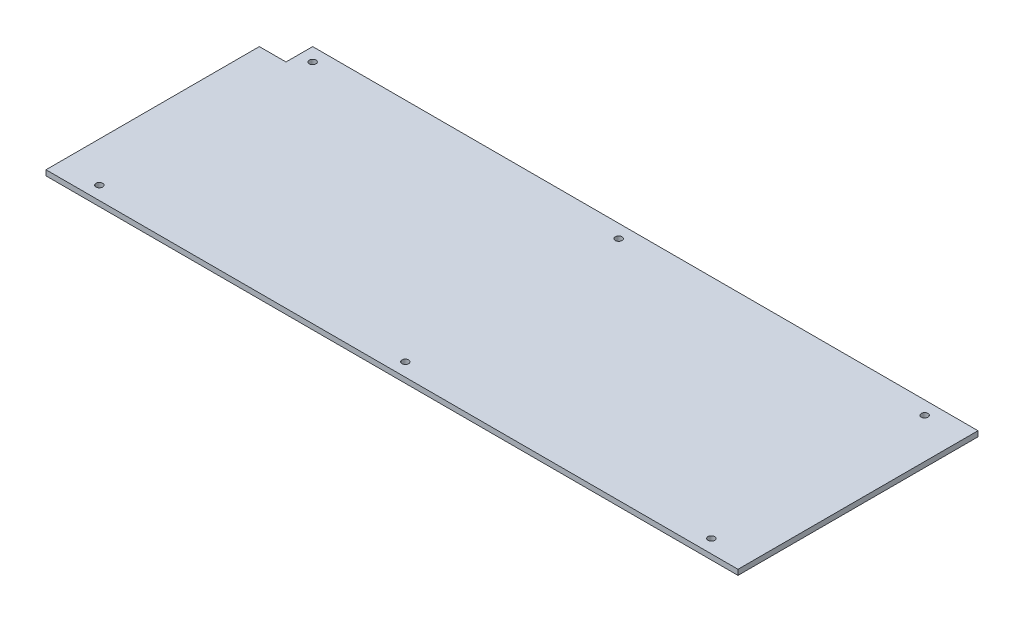
ISO-10303-21;
HEADER;
FILE_DESCRIPTION(('STEP AP214'),'2;1');
FILE_NAME('part.step','',(''),(''),'','','');
FILE_SCHEMA(('AUTOMOTIVE_DESIGN { 1 0 10303 214 1 1 1 1 }'));
ENDSEC;
DATA;
#1=APPLICATION_CONTEXT('core data for automotive mechanical design processes');
#2=APPLICATION_PROTOCOL_DEFINITION('international standard','automotive_design',2000,#1);
#3=PRODUCT_CONTEXT('',#1,'mechanical');
#4=PRODUCT('Part','Part','',(#3));
#5=PRODUCT_RELATED_PRODUCT_CATEGORY('part','',(#4));
#6=PRODUCT_DEFINITION_FORMATION('','',#4);
#7=PRODUCT_DEFINITION_CONTEXT('part definition',#1,'design');
#8=PRODUCT_DEFINITION('design','',#6,#7);
#9=PRODUCT_DEFINITION_SHAPE('','',#8);
#10=(LENGTH_UNIT() NAMED_UNIT(*) SI_UNIT(.MILLI.,.METRE.));
#11=(NAMED_UNIT(*) PLANE_ANGLE_UNIT() SI_UNIT($,.RADIAN.));
#12=(NAMED_UNIT(*) SI_UNIT($,.STERADIAN.) SOLID_ANGLE_UNIT());
#13=UNCERTAINTY_MEASURE_WITH_UNIT(LENGTH_MEASURE(1.E-05),#10,'distance_accuracy_value','');
#14=(GEOMETRIC_REPRESENTATION_CONTEXT(3) GLOBAL_UNCERTAINTY_ASSIGNED_CONTEXT((#13)) GLOBAL_UNIT_ASSIGNED_CONTEXT((#10,
#11,#12)) REPRESENTATION_CONTEXT('',''));
#15=CARTESIAN_POINT('',(0.,0.,0.));
#16=DIRECTION('',(0.,0.,1.));
#17=DIRECTION('',(1.,0.,0.));
#18=AXIS2_PLACEMENT_3D('',#15,#16,#17);
#19=CARTESIAN_POINT('',(0.,4.,0.));
#20=DIRECTION('',(0.,1.,0.));
#21=DIRECTION('',(0.,0.,1.));
#22=AXIS2_PLACEMENT_3D('',#19,#20,#21);
#23=PLANE('',#22);
#24=CARTESIAN_POINT('',(0.,4.,-80.0000000000001));
#25=DIRECTION('',(0.,1.,0.));
#26=DIRECTION('',(0.,0.,1.));
#27=AXIS2_PLACEMENT_3D('',#24,#25,#26);
#28=CIRCLE('',#27,2.5);
#29=CARTESIAN_POINT('',(0.,4.,-77.5000000000001));
#30=VERTEX_POINT('',#29);
#31=EDGE_CURVE('E220',#30,#30,#28,.T.);
#32=ORIENTED_EDGE('',*,*,#31,.F.);
#33=EDGE_LOOP('',(#32));
#34=FACE_BOUND('',#33,.T.);
#35=CARTESIAN_POINT('',(-229.5,4.,80.));
#36=DIRECTION('',(0.,1.,0.));
#37=DIRECTION('',(0.,0.,-1.));
#38=AXIS2_PLACEMENT_3D('',#35,#36,#37);
#39=CIRCLE('',#38,2.5);
#40=CARTESIAN_POINT('',(-229.5,4.,77.5));
#41=VERTEX_POINT('',#40);
#42=EDGE_CURVE('E236',#41,#41,#39,.T.);
#43=ORIENTED_EDGE('',*,*,#42,.F.);
#44=EDGE_LOOP('',(#43));
#45=FACE_BOUND('',#44,.T.);
#46=CARTESIAN_POINT('',(-229.5,4.,-80.));
#47=DIRECTION('',(0.,1.,0.));
#48=DIRECTION('',(0.,0.,1.));
#49=AXIS2_PLACEMENT_3D('',#46,#47,#48);
#50=CIRCLE('',#49,2.5);
#51=CARTESIAN_POINT('',(-229.5,4.,-77.5));
#52=VERTEX_POINT('',#51);
#53=EDGE_CURVE('E134',#52,#52,#50,.T.);
#54=ORIENTED_EDGE('',*,*,#53,.F.);
#55=EDGE_LOOP('',(#54));
#56=FACE_BOUND('',#55,.T.);
#57=DIRECTION('',(-1.,0.,0.));
#58=VECTOR('',#57,1.);
#59=CARTESIAN_POINT('',(259.5,4.,-90.0000000000001));
#60=LINE('',#59,#58);
#61=CARTESIAN_POINT('',(259.5,4.,-90.0000000000001));
#62=VERTEX_POINT('',#61);
#63=CARTESIAN_POINT('',(-239.5,4.,-90.));
#64=VERTEX_POINT('',#63);
#65=EDGE_CURVE('E146',#62,#64,#60,.T.);
#66=ORIENTED_EDGE('',*,*,#65,.T.);
#67=DIRECTION('',(0.,0.,1.));
#68=VECTOR('',#67,1.);
#69=CARTESIAN_POINT('',(-239.5,4.,-90.));
#70=LINE('',#69,#68);
#71=CARTESIAN_POINT('',(-239.5,4.,-70.));
#72=VERTEX_POINT('',#71);
#73=EDGE_CURVE('E94',#64,#72,#70,.T.);
#74=ORIENTED_EDGE('',*,*,#73,.T.);
#75=DIRECTION('',(-1.,0.,0.));
#76=VECTOR('',#75,1.);
#77=CARTESIAN_POINT('',(-259.5,4.,-70.));
#78=LINE('',#77,#76);
#79=CARTESIAN_POINT('',(-259.5,4.,-70.));
#80=VERTEX_POINT('',#79);
#81=EDGE_CURVE('E107',#72,#80,#78,.T.);
#82=ORIENTED_EDGE('',*,*,#81,.T.);
#83=DIRECTION('',(0.,0.,1.));
#84=VECTOR('',#83,1.);
#85=CARTESIAN_POINT('',(-259.5,4.,-70.));
#86=LINE('',#85,#84);
#87=CARTESIAN_POINT('',(-259.5,4.,90.));
#88=VERTEX_POINT('',#87);
#89=EDGE_CURVE('E101',#80,#88,#86,.T.);
#90=ORIENTED_EDGE('',*,*,#89,.T.);
#91=DIRECTION('',(1.,0.,0.));
#92=VECTOR('',#91,1.);
#93=CARTESIAN_POINT('',(-259.5,4.,90.));
#94=LINE('',#93,#92);
#95=CARTESIAN_POINT('',(259.5,4.,90.0000000000001));
#96=VERTEX_POINT('',#95);
#97=EDGE_CURVE('E105',#88,#96,#94,.T.);
#98=ORIENTED_EDGE('',*,*,#97,.T.);
#99=DIRECTION('',(0.,0.,-1.));
#100=VECTOR('',#99,1.);
#101=CARTESIAN_POINT('',(259.5,4.,90.0000000000001));
#102=LINE('',#101,#100);
#103=EDGE_CURVE('E57',#96,#62,#102,.T.);
#104=ORIENTED_EDGE('',*,*,#103,.T.);
#105=EDGE_LOOP('',(#66,#74,#82,#90,#98,#104));
#106=FACE_BOUND('',#105,.T.);
#107=CARTESIAN_POINT('',(229.5,4.,-80.0000000000001));
#108=DIRECTION('',(0.,1.,0.));
#109=DIRECTION('',(0.,0.,-1.));
#110=AXIS2_PLACEMENT_3D('',#107,#108,#109);
#111=CIRCLE('',#110,2.5);
#112=CARTESIAN_POINT('',(229.5,4.,-82.5000000000001));
#113=VERTEX_POINT('',#112);
#114=EDGE_CURVE('E244',#113,#113,#111,.T.);
#115=ORIENTED_EDGE('',*,*,#114,.F.);
#116=EDGE_LOOP('',(#115));
#117=FACE_BOUND('',#116,.T.);
#118=CARTESIAN_POINT('',(229.5,4.,80.0000000000001));
#119=DIRECTION('',(0.,1.,0.));
#120=DIRECTION('',(0.,0.,1.));
#121=AXIS2_PLACEMENT_3D('',#118,#119,#120);
#122=CIRCLE('',#121,2.5);
#123=CARTESIAN_POINT('',(229.5,4.,82.5000000000001));
#124=VERTEX_POINT('',#123);
#125=EDGE_CURVE('E228',#124,#124,#122,.T.);
#126=ORIENTED_EDGE('',*,*,#125,.F.);
#127=EDGE_LOOP('',(#126));
#128=FACE_BOUND('',#127,.T.);
#129=CARTESIAN_POINT('',(0.,4.,80.));
#130=DIRECTION('',(0.,1.,0.));
#131=DIRECTION('',(0.,0.,-1.));
#132=AXIS2_PLACEMENT_3D('',#129,#130,#131);
#133=CIRCLE('',#132,2.5);
#134=CARTESIAN_POINT('',(0.,4.,77.5));
#135=VERTEX_POINT('',#134);
#136=EDGE_CURVE('E209',#135,#135,#133,.T.);
#137=ORIENTED_EDGE('',*,*,#136,.F.);
#138=EDGE_LOOP('',(#137));
#139=FACE_BOUND('',#138,.T.);
#140=ADVANCED_FACE('F39',(#34,#45,#56,#106,#117,#128,#139),#23,.T.);
#141=CARTESIAN_POINT('',(0.,0.,0.));
#142=DIRECTION('',(0.,1.,0.));
#143=DIRECTION('',(0.,0.,1.));
#144=AXIS2_PLACEMENT_3D('',#141,#142,#143);
#145=PLANE('',#144);
#146=DIRECTION('',(-1.,0.,0.));
#147=VECTOR('',#146,1.);
#148=CARTESIAN_POINT('',(259.5,0.,-90.0000000000001));
#149=LINE('',#148,#147);
#150=CARTESIAN_POINT('',(259.5,0.,-90.0000000000001));
#151=VERTEX_POINT('',#150);
#152=CARTESIAN_POINT('',(-239.5,0.,-90.));
#153=VERTEX_POINT('',#152);
#154=EDGE_CURVE('E129',#151,#153,#149,.T.);
#155=ORIENTED_EDGE('',*,*,#154,.F.);
#156=DIRECTION('',(0.,0.,-1.));
#157=VECTOR('',#156,1.);
#158=CARTESIAN_POINT('',(259.5,0.,90.0000000000001));
#159=LINE('',#158,#157);
#160=CARTESIAN_POINT('',(259.5,0.,90.0000000000001));
#161=VERTEX_POINT('',#160);
#162=EDGE_CURVE('E86',#161,#151,#159,.T.);
#163=ORIENTED_EDGE('',*,*,#162,.F.);
#164=DIRECTION('',(1.,0.,0.));
#165=VECTOR('',#164,1.);
#166=CARTESIAN_POINT('',(-259.5,0.,90.));
#167=LINE('',#166,#165);
#168=CARTESIAN_POINT('',(-259.5,0.,90.));
#169=VERTEX_POINT('',#168);
#170=EDGE_CURVE('E80',#169,#161,#167,.T.);
#171=ORIENTED_EDGE('',*,*,#170,.F.);
#172=DIRECTION('',(0.,0.,1.));
#173=VECTOR('',#172,1.);
#174=CARTESIAN_POINT('',(-259.5,0.,-70.));
#175=LINE('',#174,#173);
#176=CARTESIAN_POINT('',(-259.5,0.,-70.));
#177=VERTEX_POINT('',#176);
#178=EDGE_CURVE('E116',#177,#169,#175,.T.);
#179=ORIENTED_EDGE('',*,*,#178,.F.);
#180=DIRECTION('',(-1.,0.,0.));
#181=VECTOR('',#180,1.);
#182=CARTESIAN_POINT('',(-259.5,0.,-70.));
#183=LINE('',#182,#181);
#184=CARTESIAN_POINT('',(-239.5,0.,-70.));
#185=VERTEX_POINT('',#184);
#186=EDGE_CURVE('E137',#185,#177,#183,.T.);
#187=ORIENTED_EDGE('',*,*,#186,.F.);
#188=DIRECTION('',(0.,0.,1.));
#189=VECTOR('',#188,1.);
#190=CARTESIAN_POINT('',(-239.5,0.,-90.));
#191=LINE('',#190,#189);
#192=EDGE_CURVE('E133',#153,#185,#191,.T.);
#193=ORIENTED_EDGE('',*,*,#192,.F.);
#194=EDGE_LOOP('',(#155,#163,#171,#179,#187,#193));
#195=FACE_BOUND('',#194,.T.);
#196=CARTESIAN_POINT('',(-229.5,0.,-80.));
#197=DIRECTION('',(0.,1.,0.));
#198=DIRECTION('',(0.,0.,1.));
#199=AXIS2_PLACEMENT_3D('',#196,#197,#198);
#200=CIRCLE('',#199,2.5);
#201=CARTESIAN_POINT('',(-229.5,0.,-77.5));
#202=VERTEX_POINT('',#201);
#203=EDGE_CURVE('E248',#202,#202,#200,.T.);
#204=ORIENTED_EDGE('',*,*,#203,.T.);
#205=EDGE_LOOP('',(#204));
#206=FACE_BOUND('',#205,.T.);
#207=CARTESIAN_POINT('',(229.5,0.,-80.0000000000001));
#208=DIRECTION('',(0.,1.,0.));
#209=DIRECTION('',(0.,0.,-1.));
#210=AXIS2_PLACEMENT_3D('',#207,#208,#209);
#211=CIRCLE('',#210,2.5);
#212=CARTESIAN_POINT('',(229.5,0.,-82.5000000000001));
#213=VERTEX_POINT('',#212);
#214=EDGE_CURVE('E240',#213,#213,#211,.T.);
#215=ORIENTED_EDGE('',*,*,#214,.T.);
#216=EDGE_LOOP('',(#215));
#217=FACE_BOUND('',#216,.T.);
#218=CARTESIAN_POINT('',(-229.5,0.,80.));
#219=DIRECTION('',(0.,1.,0.));
#220=DIRECTION('',(0.,0.,-1.));
#221=AXIS2_PLACEMENT_3D('',#218,#219,#220);
#222=CIRCLE('',#221,2.5);
#223=CARTESIAN_POINT('',(-229.5,0.,77.5));
#224=VERTEX_POINT('',#223);
#225=EDGE_CURVE('E232',#224,#224,#222,.T.);
#226=ORIENTED_EDGE('',*,*,#225,.T.);
#227=EDGE_LOOP('',(#226));
#228=FACE_BOUND('',#227,.T.);
#229=CARTESIAN_POINT('',(229.5,0.,80.0000000000001));
#230=DIRECTION('',(0.,1.,0.));
#231=DIRECTION('',(0.,0.,1.));
#232=AXIS2_PLACEMENT_3D('',#229,#230,#231);
#233=CIRCLE('',#232,2.5);
#234=CARTESIAN_POINT('',(229.5,0.,82.5000000000001));
#235=VERTEX_POINT('',#234);
#236=EDGE_CURVE('E224',#235,#235,#233,.T.);
#237=ORIENTED_EDGE('',*,*,#236,.T.);
#238=EDGE_LOOP('',(#237));
#239=FACE_BOUND('',#238,.T.);
#240=CARTESIAN_POINT('',(0.,0.,-80.0000000000001));
#241=DIRECTION('',(0.,1.,0.));
#242=DIRECTION('',(0.,0.,1.));
#243=AXIS2_PLACEMENT_3D('',#240,#241,#242);
#244=CIRCLE('',#243,2.5);
#245=CARTESIAN_POINT('',(0.,0.,-77.5000000000001));
#246=VERTEX_POINT('',#245);
#247=EDGE_CURVE('E217',#246,#246,#244,.T.);
#248=ORIENTED_EDGE('',*,*,#247,.T.);
#249=EDGE_LOOP('',(#248));
#250=FACE_BOUND('',#249,.T.);
#251=CARTESIAN_POINT('',(0.,0.,80.));
#252=DIRECTION('',(0.,1.,0.));
#253=DIRECTION('',(0.,0.,-1.));
#254=AXIS2_PLACEMENT_3D('',#251,#252,#253);
#255=CIRCLE('',#254,2.5);
#256=CARTESIAN_POINT('',(0.,0.,77.5));
#257=VERTEX_POINT('',#256);
#258=EDGE_CURVE('E212',#257,#257,#255,.T.);
#259=ORIENTED_EDGE('',*,*,#258,.T.);
#260=EDGE_LOOP('',(#259));
#261=FACE_BOUND('',#260,.T.);
#262=ADVANCED_FACE('F159',(#195,#206,#217,#228,#239,#250,#261),#145,.F.);
#263=CARTESIAN_POINT('',(259.5,4.,-90.0000000000001));
#264=DIRECTION('',(0.,0.,1.));
#265=DIRECTION('',(1.,0.,0.));
#266=AXIS2_PLACEMENT_3D('',#263,#264,#265);
#267=PLANE('',#266);
#268=ORIENTED_EDGE('',*,*,#154,.T.);
#269=DIRECTION('',(0.,-1.,0.));
#270=VECTOR('',#269,1.);
#271=CARTESIAN_POINT('',(-239.5,4.,-90.));
#272=LINE('',#271,#270);
#273=EDGE_CURVE('E11',#64,#153,#272,.T.);
#274=ORIENTED_EDGE('',*,*,#273,.F.);
#275=ORIENTED_EDGE('',*,*,#65,.F.);
#276=DIRECTION('',(0.,-1.,0.));
#277=VECTOR('',#276,1.);
#278=CARTESIAN_POINT('',(259.5,4.,-90.0000000000001));
#279=LINE('',#278,#277);
#280=EDGE_CURVE('E125',#62,#151,#279,.T.);
#281=ORIENTED_EDGE('',*,*,#280,.T.);
#282=EDGE_LOOP('',(#268,#274,#275,#281));
#283=FACE_BOUND('',#282,.T.);
#284=ADVANCED_FACE('F41',(#283),#267,.F.);
#285=CARTESIAN_POINT('',(-239.5,4.,-90.));
#286=DIRECTION('',(1.,0.,0.));
#287=DIRECTION('',(0.,0.,-1.));
#288=AXIS2_PLACEMENT_3D('',#285,#286,#287);
#289=PLANE('',#288);
#290=ORIENTED_EDGE('',*,*,#192,.T.);
#291=DIRECTION('',(0.,-1.,0.));
#292=VECTOR('',#291,1.);
#293=CARTESIAN_POINT('',(-239.5,4.,-70.));
#294=LINE('',#293,#292);
#295=EDGE_CURVE('E49',#72,#185,#294,.T.);
#296=ORIENTED_EDGE('',*,*,#295,.F.);
#297=ORIENTED_EDGE('',*,*,#73,.F.);
#298=ORIENTED_EDGE('',*,*,#273,.T.);
#299=EDGE_LOOP('',(#290,#296,#297,#298));
#300=FACE_BOUND('',#299,.T.);
#301=ADVANCED_FACE('F330',(#300),#289,.F.);
#302=CARTESIAN_POINT('',(-259.5,4.,-70.));
#303=DIRECTION('',(0.,0.,1.));
#304=DIRECTION('',(1.,0.,0.));
#305=AXIS2_PLACEMENT_3D('',#302,#303,#304);
#306=PLANE('',#305);
#307=ORIENTED_EDGE('',*,*,#186,.T.);
#308=DIRECTION('',(0.,-1.,0.));
#309=VECTOR('',#308,1.);
#310=CARTESIAN_POINT('',(-259.5,4.,-70.));
#311=LINE('',#310,#309);
#312=EDGE_CURVE('E118',#80,#177,#311,.T.);
#313=ORIENTED_EDGE('',*,*,#312,.F.);
#314=ORIENTED_EDGE('',*,*,#81,.F.);
#315=ORIENTED_EDGE('',*,*,#295,.T.);
#316=EDGE_LOOP('',(#307,#313,#314,#315));
#317=FACE_BOUND('',#316,.T.);
#318=ADVANCED_FACE('F156',(#317),#306,.F.);
#319=CARTESIAN_POINT('',(-259.5,4.,-70.));
#320=DIRECTION('',(1.,0.,0.));
#321=DIRECTION('',(0.,0.,-1.));
#322=AXIS2_PLACEMENT_3D('',#319,#320,#321);
#323=PLANE('',#322);
#324=ORIENTED_EDGE('',*,*,#178,.T.);
#325=DIRECTION('',(0.,-1.,0.));
#326=VECTOR('',#325,1.);
#327=CARTESIAN_POINT('',(-259.5,4.,90.));
#328=LINE('',#327,#326);
#329=EDGE_CURVE('E113',#88,#169,#328,.T.);
#330=ORIENTED_EDGE('',*,*,#329,.F.);
#331=ORIENTED_EDGE('',*,*,#89,.F.);
#332=ORIENTED_EDGE('',*,*,#312,.T.);
#333=EDGE_LOOP('',(#324,#330,#331,#332));
#334=FACE_BOUND('',#333,.T.);
#335=ADVANCED_FACE('F114',(#334),#323,.F.);
#336=CARTESIAN_POINT('',(-259.5,4.,90.));
#337=DIRECTION('',(0.,0.,-1.));
#338=DIRECTION('',(-1.,0.,0.));
#339=AXIS2_PLACEMENT_3D('',#336,#337,#338);
#340=PLANE('',#339);
#341=ORIENTED_EDGE('',*,*,#170,.T.);
#342=DIRECTION('',(0.,-1.,0.));
#343=VECTOR('',#342,1.);
#344=CARTESIAN_POINT('',(259.5,4.,90.0000000000001));
#345=LINE('',#344,#343);
#346=EDGE_CURVE('E119',#96,#161,#345,.T.);
#347=ORIENTED_EDGE('',*,*,#346,.F.);
#348=ORIENTED_EDGE('',*,*,#97,.F.);
#349=ORIENTED_EDGE('',*,*,#329,.T.);
#350=EDGE_LOOP('',(#341,#347,#348,#349));
#351=FACE_BOUND('',#350,.T.);
#352=ADVANCED_FACE('F121',(#351),#340,.F.);
#353=CARTESIAN_POINT('',(259.5,4.,90.0000000000001));
#354=DIRECTION('',(-1.,0.,0.));
#355=DIRECTION('',(0.,0.,1.));
#356=AXIS2_PLACEMENT_3D('',#353,#354,#355);
#357=PLANE('',#356);
#358=ORIENTED_EDGE('',*,*,#162,.T.);
#359=ORIENTED_EDGE('',*,*,#280,.F.);
#360=ORIENTED_EDGE('',*,*,#103,.F.);
#361=ORIENTED_EDGE('',*,*,#346,.T.);
#362=EDGE_LOOP('',(#358,#359,#360,#361));
#363=FACE_BOUND('',#362,.T.);
#364=ADVANCED_FACE('F164',(#363),#357,.F.);
#365=CARTESIAN_POINT('',(-229.5,4.,-80.));
#366=DIRECTION('',(0.,-1.,0.));
#367=DIRECTION('',(0.,0.,-1.));
#368=AXIS2_PLACEMENT_3D('',#365,#366,#367);
#369=CYLINDRICAL_SURFACE('',#368,2.5);
#370=ORIENTED_EDGE('',*,*,#53,.T.);
#371=EDGE_LOOP('',(#370));
#372=FACE_BOUND('',#371,.T.);
#373=ORIENTED_EDGE('',*,*,#203,.F.);
#374=EDGE_LOOP('',(#373));
#375=FACE_BOUND('',#374,.T.);
#376=ADVANCED_FACE('F166',(#372,#375),#369,.F.);
#377=CARTESIAN_POINT('',(229.5,4.,-80.0000000000001));
#378=DIRECTION('',(0.,-1.,0.));
#379=DIRECTION('',(0.,0.,-1.));
#380=AXIS2_PLACEMENT_3D('',#377,#378,#379);
#381=CYLINDRICAL_SURFACE('',#380,2.5);
#382=ORIENTED_EDGE('',*,*,#114,.T.);
#383=EDGE_LOOP('',(#382));
#384=FACE_BOUND('',#383,.T.);
#385=ORIENTED_EDGE('',*,*,#214,.F.);
#386=EDGE_LOOP('',(#385));
#387=FACE_BOUND('',#386,.T.);
#388=ADVANCED_FACE('F172',(#384,#387),#381,.F.);
#389=CARTESIAN_POINT('',(-229.5,4.,80.));
#390=DIRECTION('',(0.,-1.,0.));
#391=DIRECTION('',(0.,0.,-1.));
#392=AXIS2_PLACEMENT_3D('',#389,#390,#391);
#393=CYLINDRICAL_SURFACE('',#392,2.5);
#394=ORIENTED_EDGE('',*,*,#42,.T.);
#395=EDGE_LOOP('',(#394));
#396=FACE_BOUND('',#395,.T.);
#397=ORIENTED_EDGE('',*,*,#225,.F.);
#398=EDGE_LOOP('',(#397));
#399=FACE_BOUND('',#398,.T.);
#400=ADVANCED_FACE('F188',(#396,#399),#393,.F.);
#401=CARTESIAN_POINT('',(229.5,4.,80.0000000000001));
#402=DIRECTION('',(0.,-1.,0.));
#403=DIRECTION('',(0.,0.,-1.));
#404=AXIS2_PLACEMENT_3D('',#401,#402,#403);
#405=CYLINDRICAL_SURFACE('',#404,2.5);
#406=ORIENTED_EDGE('',*,*,#125,.T.);
#407=EDGE_LOOP('',(#406));
#408=FACE_BOUND('',#407,.T.);
#409=ORIENTED_EDGE('',*,*,#236,.F.);
#410=EDGE_LOOP('',(#409));
#411=FACE_BOUND('',#410,.T.);
#412=ADVANCED_FACE('F192',(#408,#411),#405,.F.);
#413=CARTESIAN_POINT('',(0.,4.,-80.0000000000001));
#414=DIRECTION('',(0.,-1.,0.));
#415=DIRECTION('',(0.,0.,-1.));
#416=AXIS2_PLACEMENT_3D('',#413,#414,#415);
#417=CYLINDRICAL_SURFACE('',#416,2.5);
#418=ORIENTED_EDGE('',*,*,#31,.T.);
#419=EDGE_LOOP('',(#418));
#420=FACE_BOUND('',#419,.T.);
#421=ORIENTED_EDGE('',*,*,#247,.F.);
#422=EDGE_LOOP('',(#421));
#423=FACE_BOUND('',#422,.T.);
#424=ADVANCED_FACE('F196',(#420,#423),#417,.F.);
#425=CARTESIAN_POINT('',(0.,4.,80.));
#426=DIRECTION('',(0.,-1.,0.));
#427=DIRECTION('',(0.,0.,-1.));
#428=AXIS2_PLACEMENT_3D('',#425,#426,#427);
#429=CYLINDRICAL_SURFACE('',#428,2.5);
#430=ORIENTED_EDGE('',*,*,#136,.T.);
#431=EDGE_LOOP('',(#430));
#432=FACE_BOUND('',#431,.T.);
#433=ORIENTED_EDGE('',*,*,#258,.F.);
#434=EDGE_LOOP('',(#433));
#435=FACE_BOUND('',#434,.T.);
#436=ADVANCED_FACE('F200',(#432,#435),#429,.F.);
#437=CLOSED_SHELL('',(#140,#262,#284,#301,#318,#335,#352,#364,#376,#388,#400,#412,#424,#436));
#438=MANIFOLD_SOLID_BREP('B2',#437);
#439=ADVANCED_BREP_SHAPE_REPRESENTATION('',(#18,#438),#14);
#440=SHAPE_DEFINITION_REPRESENTATION(#9,#439);
ENDSEC;
END-ISO-10303-21;
